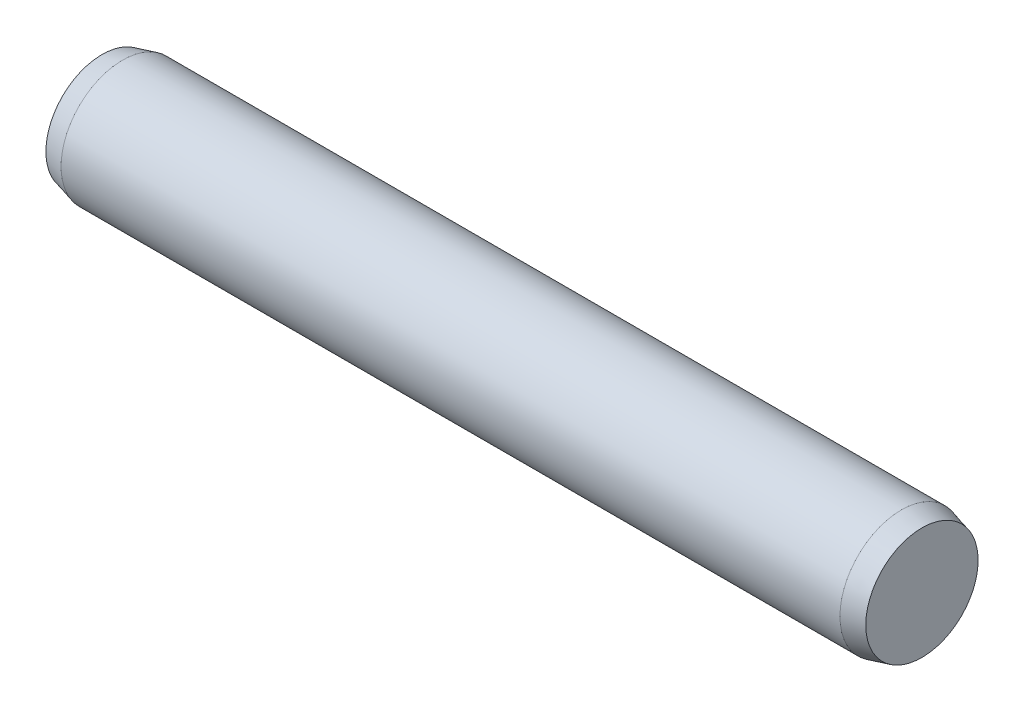
ISO-10303-21;
HEADER;
FILE_DESCRIPTION(('STEP AP214'),'2;1');
FILE_NAME('part.step','',(''),(''),'','','');
FILE_SCHEMA(('AUTOMOTIVE_DESIGN { 1 0 10303 214 1 1 1 1 }'));
ENDSEC;
DATA;
#1=APPLICATION_CONTEXT('core data for automotive mechanical design processes');
#2=APPLICATION_PROTOCOL_DEFINITION('international standard','automotive_design',2000,#1);
#3=PRODUCT_CONTEXT('',#1,'mechanical');
#4=PRODUCT('Part','Part','',(#3));
#5=PRODUCT_RELATED_PRODUCT_CATEGORY('part','',(#4));
#6=PRODUCT_DEFINITION_FORMATION('','',#4);
#7=PRODUCT_DEFINITION_CONTEXT('part definition',#1,'design');
#8=PRODUCT_DEFINITION('design','',#6,#7);
#9=PRODUCT_DEFINITION_SHAPE('','',#8);
#10=(LENGTH_UNIT() NAMED_UNIT(*) SI_UNIT(.MILLI.,.METRE.));
#11=(NAMED_UNIT(*) PLANE_ANGLE_UNIT() SI_UNIT($,.RADIAN.));
#12=(NAMED_UNIT(*) SI_UNIT($,.STERADIAN.) SOLID_ANGLE_UNIT());
#13=UNCERTAINTY_MEASURE_WITH_UNIT(LENGTH_MEASURE(1.E-05),#10,'distance_accuracy_value','');
#14=(GEOMETRIC_REPRESENTATION_CONTEXT(3) GLOBAL_UNCERTAINTY_ASSIGNED_CONTEXT((#13)) GLOBAL_UNIT_ASSIGNED_CONTEXT((#10,
#11,#12)) REPRESENTATION_CONTEXT('',''));
#15=CARTESIAN_POINT('',(0.,0.,0.));
#16=DIRECTION('',(0.,0.,1.));
#17=DIRECTION('',(1.,0.,0.));
#18=AXIS2_PLACEMENT_3D('',#15,#16,#17);
#19=CARTESIAN_POINT('',(-10.2166088223,-28.3152643177,186.13));
#20=DIRECTION('',(1.,0.,0.));
#21=DIRECTION('',(0.,0.,-1.));
#22=AXIS2_PLACEMENT_3D('',#19,#20,#21);
#23=PLANE('',#22);
#24=CARTESIAN_POINT('',(-10.2166088223044,-28.3152643177,186.13));
#25=DIRECTION('',(1.,0.,0.));
#26=DIRECTION('',(0.,0.,-1.));
#27=AXIS2_PLACEMENT_3D('',#24,#25,#26);
#28=CIRCLE('',#27,1.36999999999672);
#29=CARTESIAN_POINT('',(-10.2166088223044,-28.3152643177,184.760000000003));
#30=VERTEX_POINT('',#29);
#31=EDGE_CURVE('E17',#30,#30,#28,.T.);
#32=ORIENTED_EDGE('',*,*,#31,.F.);
#33=EDGE_LOOP('',(#32));
#34=FACE_BOUND('',#33,.T.);
#35=ADVANCED_FACE('F14',(#34),#23,.F.);
#36=CARTESIAN_POINT('',(9.7833911777,-28.3152643177,186.13));
#37=DIRECTION('',(1.,0.,0.));
#38=DIRECTION('',(0.,0.,-1.));
#39=AXIS2_PLACEMENT_3D('',#36,#37,#38);
#40=PLANE('',#39);
#41=CARTESIAN_POINT('',(9.78339117767746,-28.3152643177,186.13));
#42=DIRECTION('',(-1.,0.,0.));
#43=DIRECTION('',(0.,0.,1.));
#44=AXIS2_PLACEMENT_3D('',#41,#42,#43);
#45=CIRCLE('',#44,1.37000000002742);
#46=CARTESIAN_POINT('',(9.78339117767746,-28.3152643177,187.500000000027));
#47=VERTEX_POINT('',#46);
#48=EDGE_CURVE('E26',#47,#47,#45,.T.);
#49=ORIENTED_EDGE('',*,*,#48,.F.);
#50=EDGE_LOOP('',(#49));
#51=FACE_BOUND('',#50,.T.);
#52=ADVANCED_FACE('F37',(#51),#40,.T.);
#53=CARTESIAN_POINT('',(-9.71660882231618,-28.3152643177,186.13));
#54=DIRECTION('',(1.,0.,0.));
#55=DIRECTION('',(0.,0.,-1.));
#56=AXIS2_PLACEMENT_3D('',#53,#54,#55);
#57=CONICAL_SURFACE('',#56,1.50000000000956,0.254368058583083);
#58=CARTESIAN_POINT('',(-9.7166088223,-28.3152643177,186.13));
#59=DIRECTION('',(1.,0.,0.));
#60=DIRECTION('',(0.,0.,-1.));
#61=AXIS2_PLACEMENT_3D('',#58,#59,#60);
#62=CIRCLE('',#61,1.5);
#63=CARTESIAN_POINT('',(-9.7166088223,-28.3152643177,184.63));
#64=VERTEX_POINT('',#63);
#65=EDGE_CURVE('E21',#64,#64,#62,.T.);
#66=ORIENTED_EDGE('',*,*,#65,.F.);
#67=EDGE_LOOP('',(#66));
#68=FACE_BOUND('',#67,.T.);
#69=ORIENTED_EDGE('',*,*,#31,.T.);
#70=EDGE_LOOP('',(#69));
#71=FACE_BOUND('',#70,.T.);
#72=ADVANCED_FACE('F34',(#68,#71),#57,.T.);
#73=CARTESIAN_POINT('',(9.28339117791666,-28.3152643177,186.13));
#74=DIRECTION('',(-1.,0.,0.));
#75=DIRECTION('',(0.,0.,1.));
#76=AXIS2_PLACEMENT_3D('',#73,#74,#75);
#77=CONICAL_SURFACE('',#76,1.49999999995272,0.254368058529839);
#78=ORIENTED_EDGE('',*,*,#48,.T.);
#79=EDGE_LOOP('',(#78));
#80=FACE_BOUND('',#79,.T.);
#81=CARTESIAN_POINT('',(9.2833911777,-28.3152643177,186.13));
#82=DIRECTION('',(1.,0.,0.));
#83=DIRECTION('',(0.,0.,-1.));
#84=AXIS2_PLACEMENT_3D('',#81,#82,#83);
#85=CIRCLE('',#84,1.5);
#86=CARTESIAN_POINT('',(9.2833911777,-28.3152643177,184.63));
#87=VERTEX_POINT('',#86);
#88=EDGE_CURVE('E10',#87,#87,#85,.F.);
#89=ORIENTED_EDGE('',*,*,#88,.F.);
#90=EDGE_LOOP('',(#89));
#91=FACE_BOUND('',#90,.T.);
#92=ADVANCED_FACE('F45',(#80,#91),#77,.T.);
#93=CARTESIAN_POINT('',(-9.7166088223,-28.3152643177,186.13));
#94=DIRECTION('',(1.,0.,0.));
#95=DIRECTION('',(0.,0.,-1.));
#96=AXIS2_PLACEMENT_3D('',#93,#94,#95);
#97=CYLINDRICAL_SURFACE('',#96,1.5);
#98=ORIENTED_EDGE('',*,*,#88,.T.);
#99=EDGE_LOOP('',(#98));
#100=FACE_BOUND('',#99,.T.);
#101=ORIENTED_EDGE('',*,*,#65,.T.);
#102=EDGE_LOOP('',(#101));
#103=FACE_BOUND('',#102,.T.);
#104=ADVANCED_FACE('F43',(#100,#103),#97,.T.);
#105=CLOSED_SHELL('',(#35,#52,#72,#92,#104));
#106=MANIFOLD_SOLID_BREP('B1',#105);
#107=ADVANCED_BREP_SHAPE_REPRESENTATION('',(#18,#106),#14);
#108=SHAPE_DEFINITION_REPRESENTATION(#9,#107);
ENDSEC;
END-ISO-10303-21;
